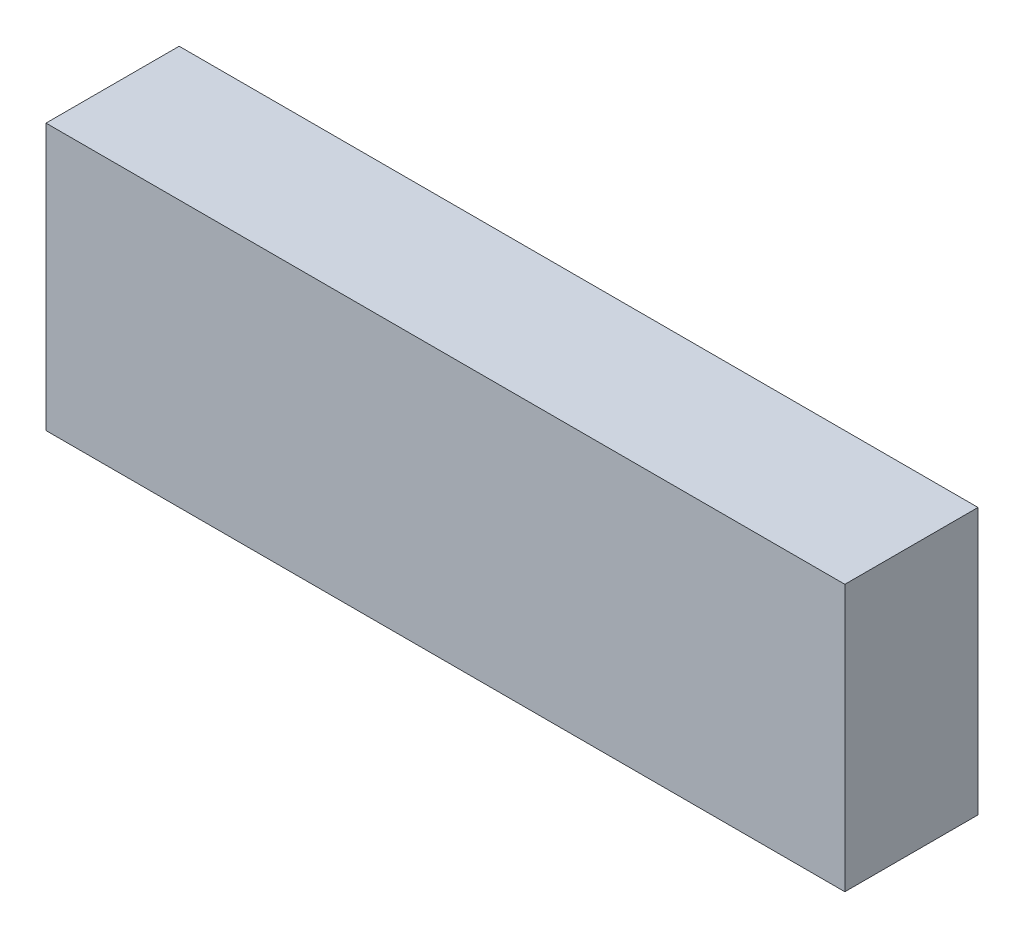
ISO-10303-21;
HEADER;
FILE_DESCRIPTION(('STEP AP214'),'2;1');
FILE_NAME('part.step','',(''),(''),'','','');
FILE_SCHEMA(('AUTOMOTIVE_DESIGN { 1 0 10303 214 1 1 1 1 }'));
ENDSEC;
DATA;
#1=APPLICATION_CONTEXT('core data for automotive mechanical design processes');
#2=APPLICATION_PROTOCOL_DEFINITION('international standard','automotive_design',2000,#1);
#3=PRODUCT_CONTEXT('',#1,'mechanical');
#4=PRODUCT('Part','Part','',(#3));
#5=PRODUCT_RELATED_PRODUCT_CATEGORY('part','',(#4));
#6=PRODUCT_DEFINITION_FORMATION('','',#4);
#7=PRODUCT_DEFINITION_CONTEXT('part definition',#1,'design');
#8=PRODUCT_DEFINITION('design','',#6,#7);
#9=PRODUCT_DEFINITION_SHAPE('','',#8);
#10=(LENGTH_UNIT() NAMED_UNIT(*) SI_UNIT(.MILLI.,.METRE.));
#11=(NAMED_UNIT(*) PLANE_ANGLE_UNIT() SI_UNIT($,.RADIAN.));
#12=(NAMED_UNIT(*) SI_UNIT($,.STERADIAN.) SOLID_ANGLE_UNIT());
#13=UNCERTAINTY_MEASURE_WITH_UNIT(LENGTH_MEASURE(1.E-05),#10,'distance_accuracy_value','');
#14=(GEOMETRIC_REPRESENTATION_CONTEXT(3) GLOBAL_UNCERTAINTY_ASSIGNED_CONTEXT((#13)) GLOBAL_UNIT_ASSIGNED_CONTEXT((#10,
#11,#12)) REPRESENTATION_CONTEXT('',''));
#15=CARTESIAN_POINT('',(0.,0.,0.));
#16=DIRECTION('',(0.,0.,1.));
#17=DIRECTION('',(1.,0.,0.));
#18=AXIS2_PLACEMENT_3D('',#15,#16,#17);
#19=CARTESIAN_POINT('',(1.375,0.225,0.));
#20=DIRECTION('',(1.,0.,0.));
#21=DIRECTION('',(0.,0.,1.));
#22=AXIS2_PLACEMENT_3D('',#19,#20,#21);
#23=PLANE('',#22);
#24=DIRECTION('',(0.,1.,0.));
#25=VECTOR('',#24,1.);
#26=CARTESIAN_POINT('',(1.375,0.225,0.1));
#27=LINE('',#26,#25);
#28=CARTESIAN_POINT('',(1.375,0.225,0.1));
#29=VERTEX_POINT('',#28);
#30=CARTESIAN_POINT('',(1.375,0.425,0.1));
#31=VERTEX_POINT('',#30);
#32=EDGE_CURVE('E11',#29,#31,#27,.T.);
#33=ORIENTED_EDGE('',*,*,#32,.T.);
#34=DIRECTION('',(0.,0.,1.));
#35=VECTOR('',#34,1.);
#36=CARTESIAN_POINT('',(1.375,0.425,0.));
#37=LINE('',#36,#35);
#38=CARTESIAN_POINT('',(1.375,0.425,0.));
#39=VERTEX_POINT('',#38);
#40=EDGE_CURVE('E24',#39,#31,#37,.T.);
#41=ORIENTED_EDGE('',*,*,#40,.F.);
#42=DIRECTION('',(0.,1.,0.));
#43=VECTOR('',#42,1.);
#44=CARTESIAN_POINT('',(1.375,0.225,0.));
#45=LINE('',#44,#43);
#46=CARTESIAN_POINT('',(1.375,0.225,0.));
#47=VERTEX_POINT('',#46);
#48=EDGE_CURVE('E86',#47,#39,#45,.T.);
#49=ORIENTED_EDGE('',*,*,#48,.F.);
#50=DIRECTION('',(0.,0.,1.));
#51=VECTOR('',#50,1.);
#52=CARTESIAN_POINT('',(1.375,0.225,0.));
#53=LINE('',#52,#51);
#54=EDGE_CURVE('E36',#47,#29,#53,.T.);
#55=ORIENTED_EDGE('',*,*,#54,.T.);
#56=EDGE_LOOP('',(#33,#41,#49,#55));
#57=FACE_BOUND('',#56,.T.);
#58=ADVANCED_FACE('F17',(#57),#23,.F.);
#59=CARTESIAN_POINT('',(1.975,0.225,0.));
#60=DIRECTION('',(1.,0.,0.));
#61=DIRECTION('',(0.,0.,1.));
#62=AXIS2_PLACEMENT_3D('',#59,#60,#61);
#63=PLANE('',#62);
#64=DIRECTION('',(0.,0.,1.));
#65=VECTOR('',#64,1.);
#66=CARTESIAN_POINT('',(1.975,0.225,0.));
#67=LINE('',#66,#65);
#68=CARTESIAN_POINT('',(1.975,0.225,0.));
#69=VERTEX_POINT('',#68);
#70=CARTESIAN_POINT('',(1.975,0.225,0.1));
#71=VERTEX_POINT('',#70);
#72=EDGE_CURVE('E83',#69,#71,#67,.T.);
#73=ORIENTED_EDGE('',*,*,#72,.F.);
#74=DIRECTION('',(0.,1.,0.));
#75=VECTOR('',#74,1.);
#76=CARTESIAN_POINT('',(1.975,0.225,0.));
#77=LINE('',#76,#75);
#78=CARTESIAN_POINT('',(1.975,0.425,0.));
#79=VERTEX_POINT('',#78);
#80=EDGE_CURVE('E63',#69,#79,#77,.T.);
#81=ORIENTED_EDGE('',*,*,#80,.T.);
#82=DIRECTION('',(0.,0.,1.));
#83=VECTOR('',#82,1.);
#84=CARTESIAN_POINT('',(1.975,0.425,0.));
#85=LINE('',#84,#83);
#86=CARTESIAN_POINT('',(1.975,0.425,0.1));
#87=VERTEX_POINT('',#86);
#88=EDGE_CURVE('E57',#79,#87,#85,.T.);
#89=ORIENTED_EDGE('',*,*,#88,.T.);
#90=DIRECTION('',(0.,1.,0.));
#91=VECTOR('',#90,1.);
#92=CARTESIAN_POINT('',(1.975,0.225,0.1));
#93=LINE('',#92,#91);
#94=EDGE_CURVE('E60',#71,#87,#93,.T.);
#95=ORIENTED_EDGE('',*,*,#94,.F.);
#96=EDGE_LOOP('',(#73,#81,#89,#95));
#97=FACE_BOUND('',#96,.T.);
#98=ADVANCED_FACE('F59',(#97),#63,.T.);
#99=CARTESIAN_POINT('',(1.375,0.225,0.));
#100=DIRECTION('',(0.,1.,0.));
#101=DIRECTION('',(0.,0.,1.));
#102=AXIS2_PLACEMENT_3D('',#99,#100,#101);
#103=PLANE('',#102);
#104=ORIENTED_EDGE('',*,*,#72,.T.);
#105=DIRECTION('',(1.,0.,0.));
#106=VECTOR('',#105,1.);
#107=CARTESIAN_POINT('',(1.375,0.225,0.1));
#108=LINE('',#107,#106);
#109=EDGE_CURVE('E71',#29,#71,#108,.T.);
#110=ORIENTED_EDGE('',*,*,#109,.F.);
#111=ORIENTED_EDGE('',*,*,#54,.F.);
#112=DIRECTION('',(1.,0.,0.));
#113=VECTOR('',#112,1.);
#114=CARTESIAN_POINT('',(1.375,0.225,0.));
#115=LINE('',#114,#113);
#116=EDGE_CURVE('E76',#47,#69,#115,.T.);
#117=ORIENTED_EDGE('',*,*,#116,.T.);
#118=EDGE_LOOP('',(#104,#110,#111,#117));
#119=FACE_BOUND('',#118,.T.);
#120=ADVANCED_FACE('F91',(#119),#103,.F.);
#121=CARTESIAN_POINT('',(1.375,0.425,0.));
#122=DIRECTION('',(0.,1.,0.));
#123=DIRECTION('',(0.,0.,1.));
#124=AXIS2_PLACEMENT_3D('',#121,#122,#123);
#125=PLANE('',#124);
#126=DIRECTION('',(1.,0.,0.));
#127=VECTOR('',#126,1.);
#128=CARTESIAN_POINT('',(1.375,0.425,0.));
#129=LINE('',#128,#127);
#130=EDGE_CURVE('E74',#39,#79,#129,.T.);
#131=ORIENTED_EDGE('',*,*,#130,.F.);
#132=ORIENTED_EDGE('',*,*,#40,.T.);
#133=DIRECTION('',(1.,0.,0.));
#134=VECTOR('',#133,1.);
#135=CARTESIAN_POINT('',(1.375,0.425,0.1));
#136=LINE('',#135,#134);
#137=EDGE_CURVE('E69',#31,#87,#136,.T.);
#138=ORIENTED_EDGE('',*,*,#137,.T.);
#139=ORIENTED_EDGE('',*,*,#88,.F.);
#140=EDGE_LOOP('',(#131,#132,#138,#139));
#141=FACE_BOUND('',#140,.T.);
#142=ADVANCED_FACE('F73',(#141),#125,.T.);
#143=CARTESIAN_POINT('',(1.375,0.225,0.));
#144=DIRECTION('',(0.,0.,1.));
#145=DIRECTION('',(1.,0.,0.));
#146=AXIS2_PLACEMENT_3D('',#143,#144,#145);
#147=PLANE('',#146);
#148=ORIENTED_EDGE('',*,*,#130,.T.);
#149=ORIENTED_EDGE('',*,*,#80,.F.);
#150=ORIENTED_EDGE('',*,*,#116,.F.);
#151=ORIENTED_EDGE('',*,*,#48,.T.);
#152=EDGE_LOOP('',(#148,#149,#150,#151));
#153=FACE_BOUND('',#152,.T.);
#154=ADVANCED_FACE('F89',(#153),#147,.F.);
#155=CARTESIAN_POINT('',(1.375,0.225,0.1));
#156=DIRECTION('',(0.,0.,1.));
#157=DIRECTION('',(1.,0.,0.));
#158=AXIS2_PLACEMENT_3D('',#155,#156,#157);
#159=PLANE('',#158);
#160=ORIENTED_EDGE('',*,*,#32,.F.);
#161=ORIENTED_EDGE('',*,*,#109,.T.);
#162=ORIENTED_EDGE('',*,*,#94,.T.);
#163=ORIENTED_EDGE('',*,*,#137,.F.);
#164=EDGE_LOOP('',(#160,#161,#162,#163));
#165=FACE_BOUND('',#164,.T.);
#166=ADVANCED_FACE('F68',(#165),#159,.T.);
#167=CLOSED_SHELL('',(#58,#98,#120,#142,#154,#166));
#168=MANIFOLD_SOLID_BREP('B1',#167);
#169=ADVANCED_BREP_SHAPE_REPRESENTATION('',(#18,#168),#14);
#170=SHAPE_DEFINITION_REPRESENTATION(#9,#169);
ENDSEC;
END-ISO-10303-21;
